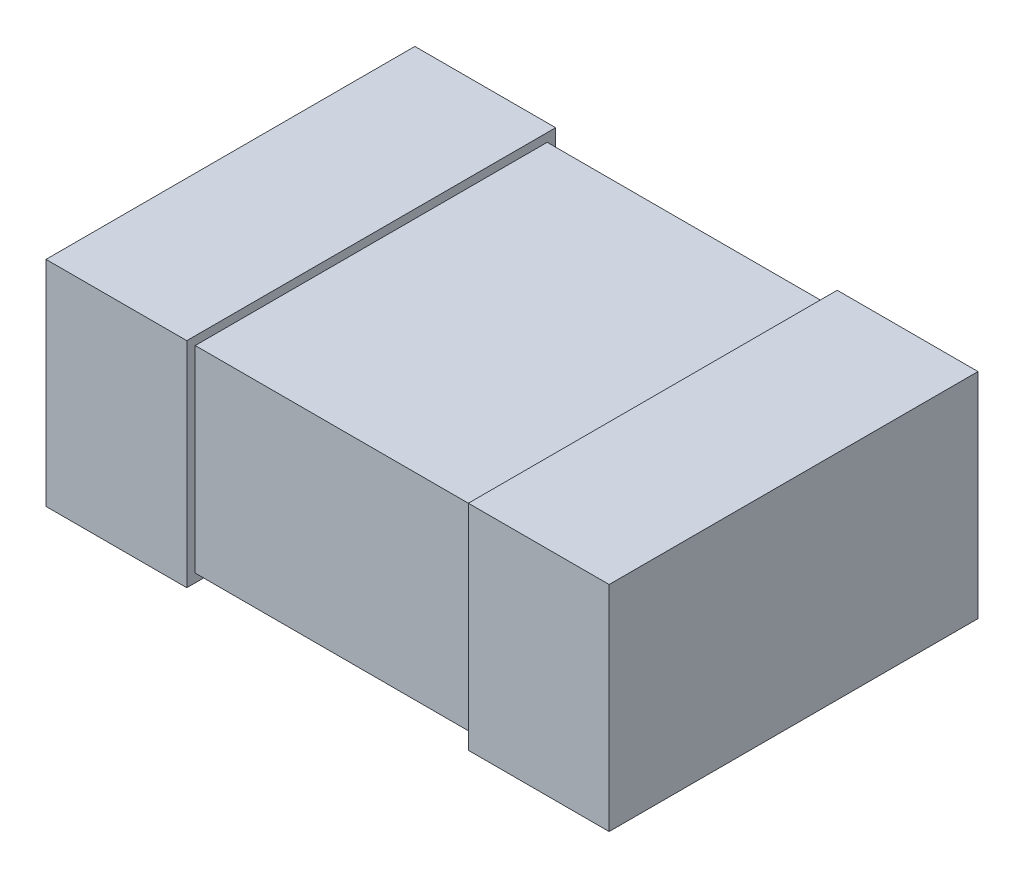
ISO-10303-21;
HEADER;
FILE_DESCRIPTION(('STEP AP214'),'2;1');
FILE_NAME('part.step','',(''),(''),'','','');
FILE_SCHEMA(('AUTOMOTIVE_DESIGN { 1 0 10303 214 1 1 1 1 }'));
ENDSEC;
DATA;
#1=APPLICATION_CONTEXT('core data for automotive mechanical design processes');
#2=APPLICATION_PROTOCOL_DEFINITION('international standard','automotive_design',2000,#1);
#3=PRODUCT_CONTEXT('',#1,'mechanical');
#4=PRODUCT('Part','Part','',(#3));
#5=PRODUCT_RELATED_PRODUCT_CATEGORY('part','',(#4));
#6=PRODUCT_DEFINITION_FORMATION('','',#4);
#7=PRODUCT_DEFINITION_CONTEXT('part definition',#1,'design');
#8=PRODUCT_DEFINITION('design','',#6,#7);
#9=PRODUCT_DEFINITION_SHAPE('','',#8);
#10=(LENGTH_UNIT() NAMED_UNIT(*) SI_UNIT(.MILLI.,.METRE.));
#11=(NAMED_UNIT(*) PLANE_ANGLE_UNIT() SI_UNIT($,.RADIAN.));
#12=(NAMED_UNIT(*) SI_UNIT($,.STERADIAN.) SOLID_ANGLE_UNIT());
#13=UNCERTAINTY_MEASURE_WITH_UNIT(LENGTH_MEASURE(1.E-05),#10,'distance_accuracy_value','');
#14=(GEOMETRIC_REPRESENTATION_CONTEXT(3) GLOBAL_UNCERTAINTY_ASSIGNED_CONTEXT((#13)) GLOBAL_UNIT_ASSIGNED_CONTEXT((#10,
#11,#12)) REPRESENTATION_CONTEXT('',''));
#15=CARTESIAN_POINT('',(0.,0.,0.));
#16=DIRECTION('',(0.,0.,1.));
#17=DIRECTION('',(1.,0.,0.));
#18=AXIS2_PLACEMENT_3D('',#15,#16,#17);
#19=CARTESIAN_POINT('',(-1.,0.7,0.625));
#20=DIRECTION('',(0.,0.,-1.));
#21=DIRECTION('',(-1.,0.,0.));
#22=AXIS2_PLACEMENT_3D('',#19,#20,#21);
#23=PLANE('',#22);
#24=DIRECTION('',(0.,-1.,0.));
#25=VECTOR('',#24,1.);
#26=CARTESIAN_POINT('',(0.5,0.7,0.625));
#27=LINE('',#26,#25);
#28=CARTESIAN_POINT('',(0.5,0.7,0.625));
#29=VERTEX_POINT('',#28);
#30=CARTESIAN_POINT('',(0.5,0.,0.625));
#31=VERTEX_POINT('',#30);
#32=EDGE_CURVE('E53',#29,#31,#27,.T.);
#33=ORIENTED_EDGE('',*,*,#32,.F.);
#34=DIRECTION('',(1.,0.,0.));
#35=VECTOR('',#34,1.);
#36=CARTESIAN_POINT('',(-1.,0.7,0.625));
#37=LINE('',#36,#35);
#38=CARTESIAN_POINT('',(-0.5,0.7,0.625));
#39=VERTEX_POINT('',#38);
#40=EDGE_CURVE('E218',#39,#29,#37,.T.);
#41=ORIENTED_EDGE('',*,*,#40,.F.);
#42=DIRECTION('',(0.,1.,0.));
#43=VECTOR('',#42,1.);
#44=CARTESIAN_POINT('',(-0.5,0.7,0.625));
#45=LINE('',#44,#43);
#46=CARTESIAN_POINT('',(-0.5,0.,0.625));
#47=VERTEX_POINT('',#46);
#48=EDGE_CURVE('E212',#47,#39,#45,.T.);
#49=ORIENTED_EDGE('',*,*,#48,.F.);
#50=DIRECTION('',(1.,0.,0.));
#51=VECTOR('',#50,1.);
#52=CARTESIAN_POINT('',(-1.,0.,0.625));
#53=LINE('',#52,#51);
#54=EDGE_CURVE('E217',#47,#31,#53,.T.);
#55=ORIENTED_EDGE('',*,*,#54,.T.);
#56=EDGE_LOOP('',(#33,#41,#49,#55));
#57=FACE_BOUND('',#56,.T.);
#58=ADVANCED_FACE('F38',(#57),#23,.F.);
#59=CARTESIAN_POINT('',(-1.,0.7,-0.625));
#60=DIRECTION('',(0.,0.,1.));
#61=DIRECTION('',(1.,0.,0.));
#62=AXIS2_PLACEMENT_3D('',#59,#60,#61);
#63=PLANE('',#62);
#64=DIRECTION('',(0.,1.,0.));
#65=VECTOR('',#64,1.);
#66=CARTESIAN_POINT('',(0.5,0.7,-0.625));
#67=LINE('',#66,#65);
#68=CARTESIAN_POINT('',(0.5,0.,-0.625));
#69=VERTEX_POINT('',#68);
#70=CARTESIAN_POINT('',(0.5,0.7,-0.625));
#71=VERTEX_POINT('',#70);
#72=EDGE_CURVE('E167',#69,#71,#67,.T.);
#73=ORIENTED_EDGE('',*,*,#72,.F.);
#74=DIRECTION('',(-1.,0.,0.));
#75=VECTOR('',#74,1.);
#76=CARTESIAN_POINT('',(-1.,0.,-0.625));
#77=LINE('',#76,#75);
#78=CARTESIAN_POINT('',(-0.5,0.,-0.625));
#79=VERTEX_POINT('',#78);
#80=EDGE_CURVE('E221',#69,#79,#77,.T.);
#81=ORIENTED_EDGE('',*,*,#80,.T.);
#82=DIRECTION('',(0.,-1.,0.));
#83=VECTOR('',#82,1.);
#84=CARTESIAN_POINT('',(-0.5,0.7,-0.625));
#85=LINE('',#84,#83);
#86=CARTESIAN_POINT('',(-0.5,0.7,-0.625));
#87=VERTEX_POINT('',#86);
#88=EDGE_CURVE('E200',#87,#79,#85,.T.);
#89=ORIENTED_EDGE('',*,*,#88,.F.);
#90=DIRECTION('',(-1.,0.,0.));
#91=VECTOR('',#90,1.);
#92=CARTESIAN_POINT('',(-1.,0.7,-0.625));
#93=LINE('',#92,#91);
#94=EDGE_CURVE('E220',#71,#87,#93,.T.);
#95=ORIENTED_EDGE('',*,*,#94,.F.);
#96=EDGE_LOOP('',(#73,#81,#89,#95));
#97=FACE_BOUND('',#96,.T.);
#98=ADVANCED_FACE('F238',(#97),#63,.F.);
#99=CARTESIAN_POINT('',(-1.,0.7,0.625));
#100=DIRECTION('',(0.,1.,0.));
#101=DIRECTION('',(0.,0.,1.));
#102=AXIS2_PLACEMENT_3D('',#99,#100,#101);
#103=PLANE('',#102);
#104=ORIENTED_EDGE('',*,*,#40,.T.);
#105=DIRECTION('',(0.,0.,-1.));
#106=VECTOR('',#105,1.);
#107=CARTESIAN_POINT('',(0.5,0.7,0.625));
#108=LINE('',#107,#106);
#109=EDGE_CURVE('E60',#29,#71,#108,.T.);
#110=ORIENTED_EDGE('',*,*,#109,.T.);
#111=ORIENTED_EDGE('',*,*,#94,.T.);
#112=DIRECTION('',(0.,0.,1.));
#113=VECTOR('',#112,1.);
#114=CARTESIAN_POINT('',(-0.5,0.7,0.625));
#115=LINE('',#114,#113);
#116=EDGE_CURVE('E215',#87,#39,#115,.T.);
#117=ORIENTED_EDGE('',*,*,#116,.T.);
#118=EDGE_LOOP('',(#104,#110,#111,#117));
#119=FACE_BOUND('',#118,.T.);
#120=ADVANCED_FACE('F235',(#119),#103,.T.);
#121=CARTESIAN_POINT('',(-1.,0.,0.625));
#122=DIRECTION('',(0.,1.,0.));
#123=DIRECTION('',(0.,0.,1.));
#124=AXIS2_PLACEMENT_3D('',#121,#122,#123);
#125=PLANE('',#124);
#126=DIRECTION('',(0.,0.,-1.));
#127=VECTOR('',#126,1.);
#128=CARTESIAN_POINT('',(0.5,0.,0.625));
#129=LINE('',#128,#127);
#130=EDGE_CURVE('E12',#31,#69,#129,.T.);
#131=ORIENTED_EDGE('',*,*,#130,.F.);
#132=ORIENTED_EDGE('',*,*,#54,.F.);
#133=DIRECTION('',(0.,0.,1.));
#134=VECTOR('',#133,1.);
#135=CARTESIAN_POINT('',(-0.5,0.,0.625));
#136=LINE('',#135,#134);
#137=EDGE_CURVE('E46',#79,#47,#136,.T.);
#138=ORIENTED_EDGE('',*,*,#137,.F.);
#139=ORIENTED_EDGE('',*,*,#80,.F.);
#140=EDGE_LOOP('',(#131,#132,#138,#139));
#141=FACE_BOUND('',#140,.T.);
#142=ADVANCED_FACE('F233',(#141),#125,.F.);
#143=CARTESIAN_POINT('',(-0.5,-0.0299999999999997,1.59472523324353));
#144=DIRECTION('',(0.,1.,0.));
#145=DIRECTION('',(-1.,0.,0.));
#146=AXIS2_PLACEMENT_3D('',#143,#144,#145);
#147=PLANE('',#146);
#148=DIRECTION('',(0.,0.,-1.));
#149=VECTOR('',#148,1.);
#150=CARTESIAN_POINT('',(-0.5,-0.0299999999999997,1.59472523324353));
#151=LINE('',#150,#149);
#152=CARTESIAN_POINT('',(-0.5,-0.0299999999999997,0.655));
#153=VERTEX_POINT('',#152);
#154=CARTESIAN_POINT('',(-0.5,-0.0299999999999997,-0.655));
#155=VERTEX_POINT('',#154);
#156=EDGE_CURVE('E189',#153,#155,#151,.T.);
#157=ORIENTED_EDGE('',*,*,#156,.F.);
#158=DIRECTION('',(-1.,0.,0.));
#159=VECTOR('',#158,1.);
#160=CARTESIAN_POINT('',(-0.5,-0.0299999999999997,0.655));
#161=LINE('',#160,#159);
#162=CARTESIAN_POINT('',(-1.,-0.0299999999999998,0.655));
#163=VERTEX_POINT('',#162);
#164=EDGE_CURVE('E194',#153,#163,#161,.T.);
#165=ORIENTED_EDGE('',*,*,#164,.T.);
#166=DIRECTION('',(0.,0.,-1.));
#167=VECTOR('',#166,1.);
#168=CARTESIAN_POINT('',(-1.,-0.0299999999999998,1.59472523324353));
#169=LINE('',#168,#167);
#170=CARTESIAN_POINT('',(-1.,-0.0299999999999998,-0.655));
#171=VERTEX_POINT('',#170);
#172=EDGE_CURVE('E202',#163,#171,#169,.T.);
#173=ORIENTED_EDGE('',*,*,#172,.T.);
#174=DIRECTION('',(-1.,0.,0.));
#175=VECTOR('',#174,1.);
#176=CARTESIAN_POINT('',(-0.5,-0.0299999999999997,-0.655));
#177=LINE('',#176,#175);
#178=EDGE_CURVE('E180',#155,#171,#177,.T.);
#179=ORIENTED_EDGE('',*,*,#178,.F.);
#180=EDGE_LOOP('',(#157,#165,#173,#179));
#181=FACE_BOUND('',#180,.T.);
#182=ADVANCED_FACE('F279',(#181),#147,.F.);
#183=CARTESIAN_POINT('',(-0.5,0.73,1.59472523324353));
#184=DIRECTION('',(0.,-1.,0.));
#185=DIRECTION('',(1.,0.,0.));
#186=AXIS2_PLACEMENT_3D('',#183,#184,#185);
#187=PLANE('',#186);
#188=DIRECTION('',(0.,0.,-1.));
#189=VECTOR('',#188,1.);
#190=CARTESIAN_POINT('',(-1.,0.73,1.59472523324353));
#191=LINE('',#190,#189);
#192=CARTESIAN_POINT('',(-1.,0.73,0.655));
#193=VERTEX_POINT('',#192);
#194=CARTESIAN_POINT('',(-1.,0.73,-0.655));
#195=VERTEX_POINT('',#194);
#196=EDGE_CURVE('E204',#193,#195,#191,.T.);
#197=ORIENTED_EDGE('',*,*,#196,.F.);
#198=DIRECTION('',(1.,0.,0.));
#199=VECTOR('',#198,1.);
#200=CARTESIAN_POINT('',(-0.5,0.73,0.655));
#201=LINE('',#200,#199);
#202=CARTESIAN_POINT('',(-0.5,0.73,0.655));
#203=VERTEX_POINT('',#202);
#204=EDGE_CURVE('E193',#193,#203,#201,.T.);
#205=ORIENTED_EDGE('',*,*,#204,.T.);
#206=DIRECTION('',(0.,0.,-1.));
#207=VECTOR('',#206,1.);
#208=CARTESIAN_POINT('',(-0.5,0.73,1.59472523324353));
#209=LINE('',#208,#207);
#210=CARTESIAN_POINT('',(-0.5,0.73,-0.655));
#211=VERTEX_POINT('',#210);
#212=EDGE_CURVE('E206',#203,#211,#209,.T.);
#213=ORIENTED_EDGE('',*,*,#212,.T.);
#214=DIRECTION('',(1.,0.,0.));
#215=VECTOR('',#214,1.);
#216=CARTESIAN_POINT('',(-0.5,0.73,-0.655));
#217=LINE('',#216,#215);
#218=EDGE_CURVE('E186',#195,#211,#217,.T.);
#219=ORIENTED_EDGE('',*,*,#218,.F.);
#220=EDGE_LOOP('',(#197,#205,#213,#219));
#221=FACE_BOUND('',#220,.T.);
#222=ADVANCED_FACE('F282',(#221),#187,.F.);
#223=CARTESIAN_POINT('',(-0.5,0.73,1.59472523324353));
#224=DIRECTION('',(-1.,0.,0.));
#225=DIRECTION('',(0.,0.,1.));
#226=AXIS2_PLACEMENT_3D('',#223,#224,#225);
#227=PLANE('',#226);
#228=ORIENTED_EDGE('',*,*,#116,.F.);
#229=ORIENTED_EDGE('',*,*,#88,.T.);
#230=ORIENTED_EDGE('',*,*,#137,.T.);
#231=ORIENTED_EDGE('',*,*,#48,.T.);
#232=EDGE_LOOP('',(#228,#229,#230,#231));
#233=FACE_BOUND('',#232,.T.);
#234=ORIENTED_EDGE('',*,*,#212,.F.);
#235=DIRECTION('',(0.,-1.,0.));
#236=VECTOR('',#235,1.);
#237=CARTESIAN_POINT('',(-0.5,0.73,0.655));
#238=LINE('',#237,#236);
#239=EDGE_CURVE('E197',#203,#153,#238,.T.);
#240=ORIENTED_EDGE('',*,*,#239,.T.);
#241=ORIENTED_EDGE('',*,*,#156,.T.);
#242=DIRECTION('',(0.,-1.,0.));
#243=VECTOR('',#242,1.);
#244=CARTESIAN_POINT('',(-0.5,0.73,-0.655));
#245=LINE('',#244,#243);
#246=EDGE_CURVE('E183',#211,#155,#245,.T.);
#247=ORIENTED_EDGE('',*,*,#246,.F.);
#248=EDGE_LOOP('',(#234,#240,#241,#247));
#249=FACE_BOUND('',#248,.T.);
#250=ADVANCED_FACE('F228',(#233,#249),#227,.F.);
#251=CARTESIAN_POINT('',(-1.,0.7,0.655));
#252=DIRECTION('',(0.,0.,-1.));
#253=DIRECTION('',(-1.,0.,0.));
#254=AXIS2_PLACEMENT_3D('',#251,#252,#253);
#255=PLANE('',#254);
#256=ORIENTED_EDGE('',*,*,#204,.F.);
#257=DIRECTION('',(0.,1.,0.));
#258=VECTOR('',#257,1.);
#259=CARTESIAN_POINT('',(-1.,0.73,0.655));
#260=LINE('',#259,#258);
#261=EDGE_CURVE('E190',#163,#193,#260,.T.);
#262=ORIENTED_EDGE('',*,*,#261,.F.);
#263=ORIENTED_EDGE('',*,*,#164,.F.);
#264=ORIENTED_EDGE('',*,*,#239,.F.);
#265=EDGE_LOOP('',(#256,#262,#263,#264));
#266=FACE_BOUND('',#265,.T.);
#267=ADVANCED_FACE('F274',(#266),#255,.F.);
#268=CARTESIAN_POINT('',(-1.,0.7,-0.655));
#269=DIRECTION('',(0.,0.,1.));
#270=DIRECTION('',(1.,0.,0.));
#271=AXIS2_PLACEMENT_3D('',#268,#269,#270);
#272=PLANE('',#271);
#273=ORIENTED_EDGE('',*,*,#246,.T.);
#274=ORIENTED_EDGE('',*,*,#178,.T.);
#275=DIRECTION('',(0.,1.,0.));
#276=VECTOR('',#275,1.);
#277=CARTESIAN_POINT('',(-1.,0.73,-0.655));
#278=LINE('',#277,#276);
#279=EDGE_CURVE('E177',#171,#195,#278,.T.);
#280=ORIENTED_EDGE('',*,*,#279,.T.);
#281=ORIENTED_EDGE('',*,*,#218,.T.);
#282=EDGE_LOOP('',(#273,#274,#280,#281));
#283=FACE_BOUND('',#282,.T.);
#284=ADVANCED_FACE('F271',(#283),#272,.F.);
#285=CARTESIAN_POINT('',(-1.,0.7,-0.625));
#286=DIRECTION('',(1.,0.,0.));
#287=DIRECTION('',(0.,0.,-1.));
#288=AXIS2_PLACEMENT_3D('',#285,#286,#287);
#289=PLANE('',#288);
#290=ORIENTED_EDGE('',*,*,#172,.F.);
#291=ORIENTED_EDGE('',*,*,#261,.T.);
#292=ORIENTED_EDGE('',*,*,#196,.T.);
#293=ORIENTED_EDGE('',*,*,#279,.F.);
#294=EDGE_LOOP('',(#290,#291,#292,#293));
#295=FACE_BOUND('',#294,.T.);
#296=ADVANCED_FACE('F40',(#295),#289,.F.);
#297=CARTESIAN_POINT('',(0.5,-0.0299999999999996,1.59472523324353));
#298=DIRECTION('',(0.,1.,0.));
#299=DIRECTION('',(-1.,0.,0.));
#300=AXIS2_PLACEMENT_3D('',#297,#298,#299);
#301=PLANE('',#300);
#302=DIRECTION('',(0.,0.,-1.));
#303=VECTOR('',#302,1.);
#304=CARTESIAN_POINT('',(1.,-0.0299999999999995,1.59472523324353));
#305=LINE('',#304,#303);
#306=CARTESIAN_POINT('',(1.,-0.0299999999999995,0.655));
#307=VERTEX_POINT('',#306);
#308=CARTESIAN_POINT('',(1.,-0.0299999999999995,-0.655));
#309=VERTEX_POINT('',#308);
#310=EDGE_CURVE('E140',#307,#309,#305,.T.);
#311=ORIENTED_EDGE('',*,*,#310,.F.);
#312=DIRECTION('',(-1.,0.,0.));
#313=VECTOR('',#312,1.);
#314=CARTESIAN_POINT('',(0.5,-0.0299999999999996,0.655));
#315=LINE('',#314,#313);
#316=CARTESIAN_POINT('',(0.5,-0.0299999999999996,0.655));
#317=VERTEX_POINT('',#316);
#318=EDGE_CURVE('E135',#307,#317,#315,.T.);
#319=ORIENTED_EDGE('',*,*,#318,.T.);
#320=DIRECTION('',(0.,0.,-1.));
#321=VECTOR('',#320,1.);
#322=CARTESIAN_POINT('',(0.5,-0.0299999999999996,1.59472523324353));
#323=LINE('',#322,#321);
#324=CARTESIAN_POINT('',(0.5,-0.0299999999999996,-0.655));
#325=VERTEX_POINT('',#324);
#326=EDGE_CURVE('E130',#317,#325,#323,.T.);
#327=ORIENTED_EDGE('',*,*,#326,.T.);
#328=DIRECTION('',(-1.,0.,0.));
#329=VECTOR('',#328,1.);
#330=CARTESIAN_POINT('',(0.500000000000001,-0.0299999999999996,-0.655));
#331=LINE('',#330,#329);
#332=EDGE_CURVE('E134',#309,#325,#331,.T.);
#333=ORIENTED_EDGE('',*,*,#332,.F.);
#334=EDGE_LOOP('',(#311,#319,#327,#333));
#335=FACE_BOUND('',#334,.T.);
#336=ADVANCED_FACE('F133',(#335),#301,.F.);
#337=CARTESIAN_POINT('',(0.5,0.73,1.59472523324353));
#338=DIRECTION('',(1.,0.,0.));
#339=DIRECTION('',(0.,0.,-1.));
#340=AXIS2_PLACEMENT_3D('',#337,#338,#339);
#341=PLANE('',#340);
#342=ORIENTED_EDGE('',*,*,#109,.F.);
#343=ORIENTED_EDGE('',*,*,#32,.T.);
#344=ORIENTED_EDGE('',*,*,#130,.T.);
#345=ORIENTED_EDGE('',*,*,#72,.T.);
#346=EDGE_LOOP('',(#342,#343,#344,#345));
#347=FACE_BOUND('',#346,.T.);
#348=ORIENTED_EDGE('',*,*,#326,.F.);
#349=DIRECTION('',(0.,1.,0.));
#350=VECTOR('',#349,1.);
#351=CARTESIAN_POINT('',(0.5,0.73,0.655));
#352=LINE('',#351,#350);
#353=CARTESIAN_POINT('',(0.5,0.73,0.655));
#354=VERTEX_POINT('',#353);
#355=EDGE_CURVE('E162',#317,#354,#352,.T.);
#356=ORIENTED_EDGE('',*,*,#355,.T.);
#357=DIRECTION('',(0.,0.,-1.));
#358=VECTOR('',#357,1.);
#359=CARTESIAN_POINT('',(0.5,0.73,1.59472523324353));
#360=LINE('',#359,#358);
#361=CARTESIAN_POINT('',(0.5,0.73,-0.655));
#362=VERTEX_POINT('',#361);
#363=EDGE_CURVE('E139',#354,#362,#360,.T.);
#364=ORIENTED_EDGE('',*,*,#363,.T.);
#365=DIRECTION('',(0.,1.,0.));
#366=VECTOR('',#365,1.);
#367=CARTESIAN_POINT('',(0.5,0.73,-0.655));
#368=LINE('',#367,#366);
#369=EDGE_CURVE('E147',#325,#362,#368,.T.);
#370=ORIENTED_EDGE('',*,*,#369,.F.);
#371=EDGE_LOOP('',(#348,#356,#364,#370));
#372=FACE_BOUND('',#371,.T.);
#373=ADVANCED_FACE('F152',(#347,#372),#341,.F.);
#374=CARTESIAN_POINT('',(0.5,0.73,1.59472523324353));
#375=DIRECTION('',(0.,-1.,0.));
#376=DIRECTION('',(0.,0.,-1.));
#377=AXIS2_PLACEMENT_3D('',#374,#375,#376);
#378=PLANE('',#377);
#379=ORIENTED_EDGE('',*,*,#363,.F.);
#380=DIRECTION('',(1.,0.,0.));
#381=VECTOR('',#380,1.);
#382=CARTESIAN_POINT('',(0.5,0.73,0.655));
#383=LINE('',#382,#381);
#384=CARTESIAN_POINT('',(1.,0.73,0.655));
#385=VERTEX_POINT('',#384);
#386=EDGE_CURVE('E165',#354,#385,#383,.T.);
#387=ORIENTED_EDGE('',*,*,#386,.T.);
#388=DIRECTION('',(0.,0.,-1.));
#389=VECTOR('',#388,1.);
#390=CARTESIAN_POINT('',(1.,0.73,1.59472523324353));
#391=LINE('',#390,#389);
#392=CARTESIAN_POINT('',(1.,0.73,-0.655));
#393=VERTEX_POINT('',#392);
#394=EDGE_CURVE('E154',#385,#393,#391,.T.);
#395=ORIENTED_EDGE('',*,*,#394,.T.);
#396=DIRECTION('',(1.,0.,0.));
#397=VECTOR('',#396,1.);
#398=CARTESIAN_POINT('',(0.500000000000001,0.73,-0.655));
#399=LINE('',#398,#397);
#400=EDGE_CURVE('E155',#362,#393,#399,.T.);
#401=ORIENTED_EDGE('',*,*,#400,.F.);
#402=EDGE_LOOP('',(#379,#387,#395,#401));
#403=FACE_BOUND('',#402,.T.);
#404=ADVANCED_FACE('F258',(#403),#378,.F.);
#405=CARTESIAN_POINT('',(-1.,0.7,0.655));
#406=DIRECTION('',(0.,0.,-1.));
#407=DIRECTION('',(-1.,0.,0.));
#408=AXIS2_PLACEMENT_3D('',#405,#406,#407);
#409=PLANE('',#408);
#410=ORIENTED_EDGE('',*,*,#355,.F.);
#411=ORIENTED_EDGE('',*,*,#318,.F.);
#412=DIRECTION('',(0.,-1.,0.));
#413=VECTOR('',#412,1.);
#414=CARTESIAN_POINT('',(1.,0.73,0.655));
#415=LINE('',#414,#413);
#416=EDGE_CURVE('E163',#385,#307,#415,.T.);
#417=ORIENTED_EDGE('',*,*,#416,.F.);
#418=ORIENTED_EDGE('',*,*,#386,.F.);
#419=EDGE_LOOP('',(#410,#411,#417,#418));
#420=FACE_BOUND('',#419,.T.);
#421=ADVANCED_FACE('F254',(#420),#409,.F.);
#422=CARTESIAN_POINT('',(-1.,0.7,-0.655));
#423=DIRECTION('',(0.,0.,1.));
#424=DIRECTION('',(1.,0.,0.));
#425=AXIS2_PLACEMENT_3D('',#422,#423,#424);
#426=PLANE('',#425);
#427=ORIENTED_EDGE('',*,*,#400,.T.);
#428=DIRECTION('',(0.,-1.,0.));
#429=VECTOR('',#428,1.);
#430=CARTESIAN_POINT('',(1.,0.73,-0.655));
#431=LINE('',#430,#429);
#432=EDGE_CURVE('E150',#393,#309,#431,.T.);
#433=ORIENTED_EDGE('',*,*,#432,.T.);
#434=ORIENTED_EDGE('',*,*,#332,.T.);
#435=ORIENTED_EDGE('',*,*,#369,.T.);
#436=EDGE_LOOP('',(#427,#433,#434,#435));
#437=FACE_BOUND('',#436,.T.);
#438=ADVANCED_FACE('F146',(#437),#426,.F.);
#439=CARTESIAN_POINT('',(1.,0.7,-0.625));
#440=DIRECTION('',(-1.,0.,0.));
#441=DIRECTION('',(0.,0.,1.));
#442=AXIS2_PLACEMENT_3D('',#439,#440,#441);
#443=PLANE('',#442);
#444=ORIENTED_EDGE('',*,*,#394,.F.);
#445=ORIENTED_EDGE('',*,*,#416,.T.);
#446=ORIENTED_EDGE('',*,*,#310,.T.);
#447=ORIENTED_EDGE('',*,*,#432,.F.);
#448=EDGE_LOOP('',(#444,#445,#446,#447));
#449=FACE_BOUND('',#448,.T.);
#450=ADVANCED_FACE('F248',(#449),#443,.F.);
#451=CLOSED_SHELL('',(#58,#98,#120,#142,#182,#222,#250,#267,#284,#296,#336,#373,#404,#421,#438,#450));
#452=MANIFOLD_SOLID_BREP('B2',#451);
#453=ADVANCED_BREP_SHAPE_REPRESENTATION('',(#18,#452),#14);
#454=SHAPE_DEFINITION_REPRESENTATION(#9,#453);
ENDSEC;
END-ISO-10303-21;
